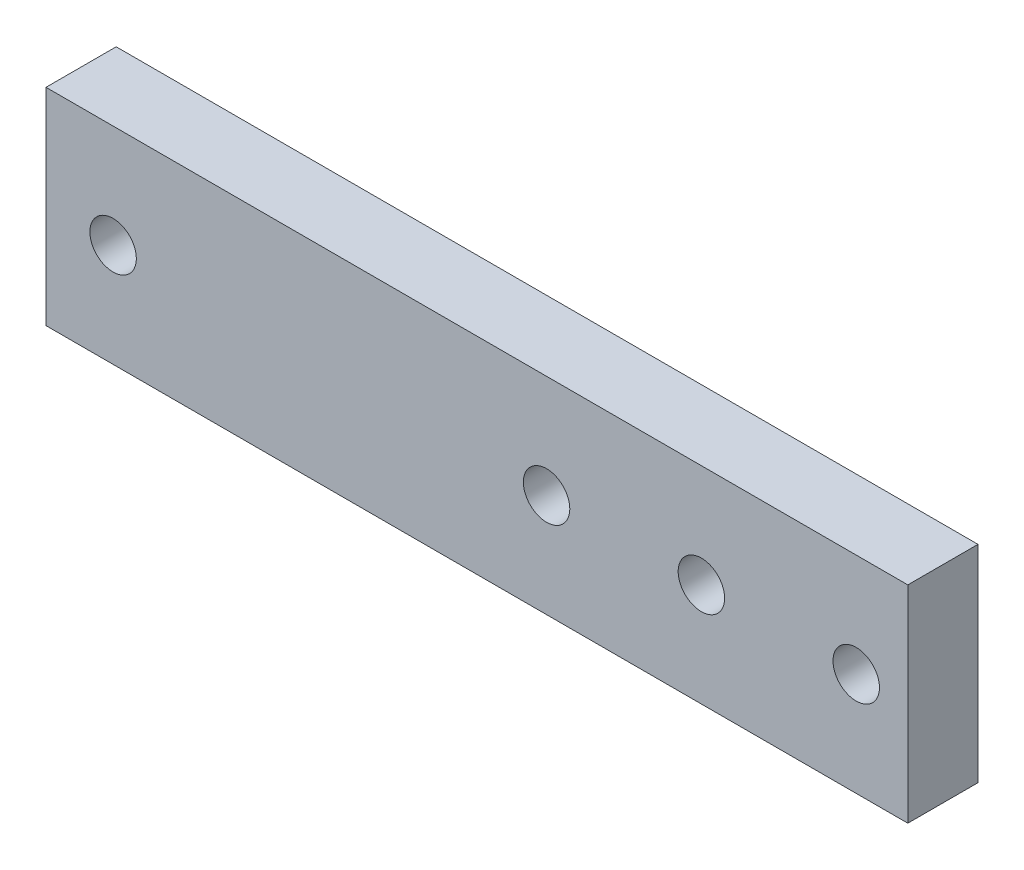
ISO-10303-21;
HEADER;
FILE_DESCRIPTION(('STEP AP214'),'2;1');
FILE_NAME('part.step','',(''),(''),'','','');
FILE_SCHEMA(('AUTOMOTIVE_DESIGN { 1 0 10303 214 1 1 1 1 }'));
ENDSEC;
DATA;
#1=APPLICATION_CONTEXT('core data for automotive mechanical design processes');
#2=APPLICATION_PROTOCOL_DEFINITION('international standard','automotive_design',2000,#1);
#3=PRODUCT_CONTEXT('',#1,'mechanical');
#4=PRODUCT('Part','Part','',(#3));
#5=PRODUCT_RELATED_PRODUCT_CATEGORY('part','',(#4));
#6=PRODUCT_DEFINITION_FORMATION('','',#4);
#7=PRODUCT_DEFINITION_CONTEXT('part definition',#1,'design');
#8=PRODUCT_DEFINITION('design','',#6,#7);
#9=PRODUCT_DEFINITION_SHAPE('','',#8);
#10=(LENGTH_UNIT() NAMED_UNIT(*) SI_UNIT(.MILLI.,.METRE.));
#11=(NAMED_UNIT(*) PLANE_ANGLE_UNIT() SI_UNIT($,.RADIAN.));
#12=(NAMED_UNIT(*) SI_UNIT($,.STERADIAN.) SOLID_ANGLE_UNIT());
#13=UNCERTAINTY_MEASURE_WITH_UNIT(LENGTH_MEASURE(1.E-05),#10,'distance_accuracy_value','');
#14=(GEOMETRIC_REPRESENTATION_CONTEXT(3) GLOBAL_UNCERTAINTY_ASSIGNED_CONTEXT((#13)) GLOBAL_UNIT_ASSIGNED_CONTEXT((#10,
#11,#12)) REPRESENTATION_CONTEXT('',''));
#15=CARTESIAN_POINT('',(0.,0.,0.));
#16=DIRECTION('',(0.,0.,1.));
#17=DIRECTION('',(1.,0.,0.));
#18=AXIS2_PLACEMENT_3D('',#15,#16,#17);
#19=CARTESIAN_POINT('',(0.,0.,6.8));
#20=DIRECTION('',(0.,0.,-1.));
#21=DIRECTION('',(-1.,0.,0.));
#22=AXIS2_PLACEMENT_3D('',#19,#20,#21);
#23=PLANE('',#22);
#24=DIRECTION('',(0.,1.,0.));
#25=VECTOR('',#24,1.);
#26=CARTESIAN_POINT('',(41.75,-10.,6.8));
#27=LINE('',#26,#25);
#28=CARTESIAN_POINT('',(41.75,-10.,6.8));
#29=VERTEX_POINT('',#28);
#30=CARTESIAN_POINT('',(41.75,10.,6.8));
#31=VERTEX_POINT('',#30);
#32=EDGE_CURVE('E89',#29,#31,#27,.T.);
#33=ORIENTED_EDGE('',*,*,#32,.T.);
#34=DIRECTION('',(-1.,0.,0.));
#35=VECTOR('',#34,1.);
#36=CARTESIAN_POINT('',(-41.75,10.,6.8));
#37=LINE('',#36,#35);
#38=CARTESIAN_POINT('',(-41.75,10.,6.8));
#39=VERTEX_POINT('',#38);
#40=EDGE_CURVE('E84',#31,#39,#37,.T.);
#41=ORIENTED_EDGE('',*,*,#40,.T.);
#42=DIRECTION('',(0.,-1.,0.));
#43=VECTOR('',#42,1.);
#44=CARTESIAN_POINT('',(-41.75,-10.,6.8));
#45=LINE('',#44,#43);
#46=CARTESIAN_POINT('',(-41.75,-10.,6.8));
#47=VERTEX_POINT('',#46);
#48=EDGE_CURVE('E87',#39,#47,#45,.T.);
#49=ORIENTED_EDGE('',*,*,#48,.T.);
#50=DIRECTION('',(1.,0.,0.));
#51=VECTOR('',#50,1.);
#52=CARTESIAN_POINT('',(-41.75,-10.,6.8));
#53=LINE('',#52,#51);
#54=EDGE_CURVE('E54',#47,#29,#53,.T.);
#55=ORIENTED_EDGE('',*,*,#54,.T.);
#56=EDGE_LOOP('',(#33,#41,#49,#55));
#57=FACE_BOUND('',#56,.T.);
#58=CARTESIAN_POINT('',(6.75000000000001,0.,6.8));
#59=DIRECTION('',(0.,0.,1.));
#60=DIRECTION('',(1.,0.,0.));
#61=AXIS2_PLACEMENT_3D('',#58,#59,#60);
#62=CIRCLE('',#61,2.25000000000001);
#63=CARTESIAN_POINT('',(9.00000000000002,0.,6.8));
#64=VERTEX_POINT('',#63);
#65=EDGE_CURVE('E104',#64,#64,#62,.T.);
#66=ORIENTED_EDGE('',*,*,#65,.F.);
#67=EDGE_LOOP('',(#66));
#68=FACE_BOUND('',#67,.T.);
#69=CARTESIAN_POINT('',(-35.25,0.,6.8));
#70=DIRECTION('',(0.,0.,1.));
#71=DIRECTION('',(-1.,0.,0.));
#72=AXIS2_PLACEMENT_3D('',#69,#70,#71);
#73=CIRCLE('',#72,2.25);
#74=CARTESIAN_POINT('',(-37.5,0.,6.8));
#75=VERTEX_POINT('',#74);
#76=EDGE_CURVE('E119',#75,#75,#73,.T.);
#77=ORIENTED_EDGE('',*,*,#76,.F.);
#78=EDGE_LOOP('',(#77));
#79=FACE_BOUND('',#78,.T.);
#80=CARTESIAN_POINT('',(21.75,0.,6.8));
#81=DIRECTION('',(0.,0.,1.));
#82=DIRECTION('',(1.,0.,0.));
#83=AXIS2_PLACEMENT_3D('',#80,#81,#82);
#84=CIRCLE('',#83,2.25);
#85=CARTESIAN_POINT('',(24.,0.,6.8));
#86=VERTEX_POINT('',#85);
#87=EDGE_CURVE('E125',#86,#86,#84,.T.);
#88=ORIENTED_EDGE('',*,*,#87,.F.);
#89=EDGE_LOOP('',(#88));
#90=FACE_BOUND('',#89,.T.);
#91=CARTESIAN_POINT('',(36.75,0.,6.8));
#92=DIRECTION('',(0.,0.,1.));
#93=DIRECTION('',(1.,0.,0.));
#94=AXIS2_PLACEMENT_3D('',#91,#92,#93);
#95=CIRCLE('',#94,2.25);
#96=CARTESIAN_POINT('',(39.,0.,6.8));
#97=VERTEX_POINT('',#96);
#98=EDGE_CURVE('E131',#97,#97,#95,.T.);
#99=ORIENTED_EDGE('',*,*,#98,.F.);
#100=EDGE_LOOP('',(#99));
#101=FACE_BOUND('',#100,.T.);
#102=ADVANCED_FACE('F37',(#57,#68,#79,#90,#101),#23,.F.);
#103=CARTESIAN_POINT('',(0.,0.,0.));
#104=DIRECTION('',(0.,0.,-1.));
#105=DIRECTION('',(-1.,0.,0.));
#106=AXIS2_PLACEMENT_3D('',#103,#104,#105);
#107=PLANE('',#106);
#108=CARTESIAN_POINT('',(21.75,0.,0.));
#109=DIRECTION('',(0.,0.,1.));
#110=DIRECTION('',(1.,0.,0.));
#111=AXIS2_PLACEMENT_3D('',#108,#109,#110);
#112=CIRCLE('',#111,2.25);
#113=CARTESIAN_POINT('',(24.,0.,0.));
#114=VERTEX_POINT('',#113);
#115=EDGE_CURVE('E128',#114,#114,#112,.T.);
#116=ORIENTED_EDGE('',*,*,#115,.T.);
#117=EDGE_LOOP('',(#116));
#118=FACE_BOUND('',#117,.T.);
#119=CARTESIAN_POINT('',(6.75000000000001,0.,0.));
#120=DIRECTION('',(0.,0.,1.));
#121=DIRECTION('',(1.,0.,0.));
#122=AXIS2_PLACEMENT_3D('',#119,#120,#121);
#123=CIRCLE('',#122,2.25000000000001);
#124=CARTESIAN_POINT('',(9.00000000000002,0.,0.));
#125=VERTEX_POINT('',#124);
#126=EDGE_CURVE('E116',#125,#125,#123,.T.);
#127=ORIENTED_EDGE('',*,*,#126,.T.);
#128=EDGE_LOOP('',(#127));
#129=FACE_BOUND('',#128,.T.);
#130=DIRECTION('',(0.,1.,0.));
#131=VECTOR('',#130,1.);
#132=CARTESIAN_POINT('',(41.75,-10.,0.));
#133=LINE('',#132,#131);
#134=CARTESIAN_POINT('',(41.75,-10.,0.));
#135=VERTEX_POINT('',#134);
#136=CARTESIAN_POINT('',(41.75,10.,0.));
#137=VERTEX_POINT('',#136);
#138=EDGE_CURVE('E101',#135,#137,#133,.T.);
#139=ORIENTED_EDGE('',*,*,#138,.F.);
#140=DIRECTION('',(1.,0.,0.));
#141=VECTOR('',#140,1.);
#142=CARTESIAN_POINT('',(-41.75,-10.,0.));
#143=LINE('',#142,#141);
#144=CARTESIAN_POINT('',(-41.75,-10.,0.));
#145=VERTEX_POINT('',#144);
#146=EDGE_CURVE('E77',#145,#135,#143,.T.);
#147=ORIENTED_EDGE('',*,*,#146,.F.);
#148=DIRECTION('',(0.,-1.,0.));
#149=VECTOR('',#148,1.);
#150=CARTESIAN_POINT('',(-41.75,-10.,0.));
#151=LINE('',#150,#149);
#152=CARTESIAN_POINT('',(-41.75,10.,0.));
#153=VERTEX_POINT('',#152);
#154=EDGE_CURVE('E71',#153,#145,#151,.T.);
#155=ORIENTED_EDGE('',*,*,#154,.F.);
#156=DIRECTION('',(-1.,0.,0.));
#157=VECTOR('',#156,1.);
#158=CARTESIAN_POINT('',(-41.75,10.,0.));
#159=LINE('',#158,#157);
#160=EDGE_CURVE('E93',#137,#153,#159,.T.);
#161=ORIENTED_EDGE('',*,*,#160,.F.);
#162=EDGE_LOOP('',(#139,#147,#155,#161));
#163=FACE_BOUND('',#162,.T.);
#164=CARTESIAN_POINT('',(-35.25,0.,0.));
#165=DIRECTION('',(0.,0.,1.));
#166=DIRECTION('',(-1.,0.,0.));
#167=AXIS2_PLACEMENT_3D('',#164,#165,#166);
#168=CIRCLE('',#167,2.25);
#169=CARTESIAN_POINT('',(-37.5,0.,0.));
#170=VERTEX_POINT('',#169);
#171=EDGE_CURVE('E122',#170,#170,#168,.T.);
#172=ORIENTED_EDGE('',*,*,#171,.T.);
#173=EDGE_LOOP('',(#172));
#174=FACE_BOUND('',#173,.T.);
#175=CARTESIAN_POINT('',(36.75,0.,0.));
#176=DIRECTION('',(0.,0.,1.));
#177=DIRECTION('',(1.,0.,0.));
#178=AXIS2_PLACEMENT_3D('',#175,#176,#177);
#179=CIRCLE('',#178,2.25);
#180=CARTESIAN_POINT('',(39.,0.,0.));
#181=VERTEX_POINT('',#180);
#182=EDGE_CURVE('E134',#181,#181,#179,.T.);
#183=ORIENTED_EDGE('',*,*,#182,.T.);
#184=EDGE_LOOP('',(#183));
#185=FACE_BOUND('',#184,.T.);
#186=ADVANCED_FACE('F112',(#118,#129,#163,#174,#185),#107,.T.);
#187=CARTESIAN_POINT('',(41.75,-10.,6.8));
#188=DIRECTION('',(-1.,0.,0.));
#189=DIRECTION('',(0.,-1.,0.));
#190=AXIS2_PLACEMENT_3D('',#187,#188,#189);
#191=PLANE('',#190);
#192=ORIENTED_EDGE('',*,*,#138,.T.);
#193=DIRECTION('',(0.,0.,-1.));
#194=VECTOR('',#193,1.);
#195=CARTESIAN_POINT('',(41.75,10.,6.8));
#196=LINE('',#195,#194);
#197=EDGE_CURVE('E11',#31,#137,#196,.T.);
#198=ORIENTED_EDGE('',*,*,#197,.F.);
#199=ORIENTED_EDGE('',*,*,#32,.F.);
#200=DIRECTION('',(0.,0.,-1.));
#201=VECTOR('',#200,1.);
#202=CARTESIAN_POINT('',(41.75,-10.,6.8));
#203=LINE('',#202,#201);
#204=EDGE_CURVE('E97',#29,#135,#203,.T.);
#205=ORIENTED_EDGE('',*,*,#204,.T.);
#206=EDGE_LOOP('',(#192,#198,#199,#205));
#207=FACE_BOUND('',#206,.T.);
#208=ADVANCED_FACE('F39',(#207),#191,.F.);
#209=CARTESIAN_POINT('',(-41.75,10.,6.8));
#210=DIRECTION('',(0.,-1.,0.));
#211=DIRECTION('',(0.,0.,-1.));
#212=AXIS2_PLACEMENT_3D('',#209,#210,#211);
#213=PLANE('',#212);
#214=ORIENTED_EDGE('',*,*,#160,.T.);
#215=DIRECTION('',(0.,0.,-1.));
#216=VECTOR('',#215,1.);
#217=CARTESIAN_POINT('',(-41.75,10.,6.8));
#218=LINE('',#217,#216);
#219=EDGE_CURVE('E46',#39,#153,#218,.T.);
#220=ORIENTED_EDGE('',*,*,#219,.F.);
#221=ORIENTED_EDGE('',*,*,#40,.F.);
#222=ORIENTED_EDGE('',*,*,#197,.T.);
#223=EDGE_LOOP('',(#214,#220,#221,#222));
#224=FACE_BOUND('',#223,.T.);
#225=ADVANCED_FACE('F92',(#224),#213,.F.);
#226=CARTESIAN_POINT('',(-41.75,-10.,6.8));
#227=DIRECTION('',(1.,0.,0.));
#228=DIRECTION('',(0.,0.,-1.));
#229=AXIS2_PLACEMENT_3D('',#226,#227,#228);
#230=PLANE('',#229);
#231=ORIENTED_EDGE('',*,*,#154,.T.);
#232=DIRECTION('',(0.,0.,-1.));
#233=VECTOR('',#232,1.);
#234=CARTESIAN_POINT('',(-41.75,-10.,6.8));
#235=LINE('',#234,#233);
#236=EDGE_CURVE('E94',#47,#145,#235,.T.);
#237=ORIENTED_EDGE('',*,*,#236,.F.);
#238=ORIENTED_EDGE('',*,*,#48,.F.);
#239=ORIENTED_EDGE('',*,*,#219,.T.);
#240=EDGE_LOOP('',(#231,#237,#238,#239));
#241=FACE_BOUND('',#240,.T.);
#242=ADVANCED_FACE('F95',(#241),#230,.F.);
#243=CARTESIAN_POINT('',(-41.75,-10.,6.8));
#244=DIRECTION('',(0.,1.,0.));
#245=DIRECTION('',(0.,0.,1.));
#246=AXIS2_PLACEMENT_3D('',#243,#244,#245);
#247=PLANE('',#246);
#248=ORIENTED_EDGE('',*,*,#146,.T.);
#249=ORIENTED_EDGE('',*,*,#204,.F.);
#250=ORIENTED_EDGE('',*,*,#54,.F.);
#251=ORIENTED_EDGE('',*,*,#236,.T.);
#252=EDGE_LOOP('',(#248,#249,#250,#251));
#253=FACE_BOUND('',#252,.T.);
#254=ADVANCED_FACE('F109',(#253),#247,.F.);
#255=CARTESIAN_POINT('',(6.75000000000001,0.,6.8));
#256=DIRECTION('',(0.,0.,-1.));
#257=DIRECTION('',(-1.,0.,0.));
#258=AXIS2_PLACEMENT_3D('',#255,#256,#257);
#259=CYLINDRICAL_SURFACE('',#258,2.25000000000001);
#260=ORIENTED_EDGE('',*,*,#65,.T.);
#261=EDGE_LOOP('',(#260));
#262=FACE_BOUND('',#261,.T.);
#263=ORIENTED_EDGE('',*,*,#126,.F.);
#264=EDGE_LOOP('',(#263));
#265=FACE_BOUND('',#264,.T.);
#266=ADVANCED_FACE('F151',(#262,#265),#259,.F.);
#267=CARTESIAN_POINT('',(-35.25,0.,6.8));
#268=DIRECTION('',(0.,0.,-1.));
#269=DIRECTION('',(-1.,0.,0.));
#270=AXIS2_PLACEMENT_3D('',#267,#268,#269);
#271=CYLINDRICAL_SURFACE('',#270,2.25);
#272=ORIENTED_EDGE('',*,*,#76,.T.);
#273=EDGE_LOOP('',(#272));
#274=FACE_BOUND('',#273,.T.);
#275=ORIENTED_EDGE('',*,*,#171,.F.);
#276=EDGE_LOOP('',(#275));
#277=FACE_BOUND('',#276,.T.);
#278=ADVANCED_FACE('F205',(#274,#277),#271,.F.);
#279=CARTESIAN_POINT('',(21.75,0.,6.8));
#280=DIRECTION('',(0.,0.,-1.));
#281=DIRECTION('',(-1.,0.,0.));
#282=AXIS2_PLACEMENT_3D('',#279,#280,#281);
#283=CYLINDRICAL_SURFACE('',#282,2.25);
#284=ORIENTED_EDGE('',*,*,#87,.T.);
#285=EDGE_LOOP('',(#284));
#286=FACE_BOUND('',#285,.T.);
#287=ORIENTED_EDGE('',*,*,#115,.F.);
#288=EDGE_LOOP('',(#287));
#289=FACE_BOUND('',#288,.T.);
#290=ADVANCED_FACE('F214',(#286,#289),#283,.F.);
#291=CARTESIAN_POINT('',(36.75,0.,6.8));
#292=DIRECTION('',(0.,0.,-1.));
#293=DIRECTION('',(-1.,0.,0.));
#294=AXIS2_PLACEMENT_3D('',#291,#292,#293);
#295=CYLINDRICAL_SURFACE('',#294,2.25);
#296=ORIENTED_EDGE('',*,*,#98,.T.);
#297=EDGE_LOOP('',(#296));
#298=FACE_BOUND('',#297,.T.);
#299=ORIENTED_EDGE('',*,*,#182,.F.);
#300=EDGE_LOOP('',(#299));
#301=FACE_BOUND('',#300,.T.);
#302=ADVANCED_FACE('F140',(#298,#301),#295,.F.);
#303=CLOSED_SHELL('',(#102,#186,#208,#225,#242,#254,#266,#278,#290,#302));
#304=MANIFOLD_SOLID_BREP('B2',#303);
#305=ADVANCED_BREP_SHAPE_REPRESENTATION('',(#18,#304),#14);
#306=SHAPE_DEFINITION_REPRESENTATION(#9,#305);
ENDSEC;
END-ISO-10303-21;
